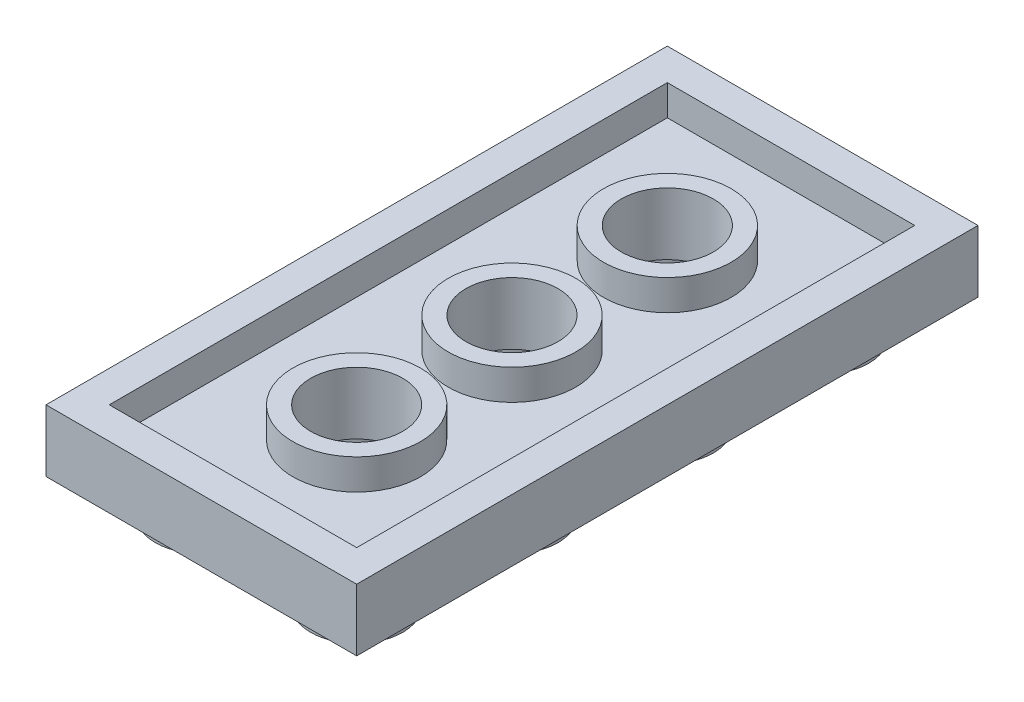
ISO-10303-21;
HEADER;
FILE_DESCRIPTION(('STEP AP214'),'2;1');
FILE_NAME('part.step','',(''),(''),'','','');
FILE_SCHEMA(('AUTOMOTIVE_DESIGN { 1 0 10303 214 1 1 1 1 }'));
ENDSEC;
DATA;
#1=APPLICATION_CONTEXT('core data for automotive mechanical design processes');
#2=APPLICATION_PROTOCOL_DEFINITION('international standard','automotive_design',2000,#1);
#3=PRODUCT_CONTEXT('',#1,'mechanical');
#4=PRODUCT('Part','Part','',(#3));
#5=PRODUCT_RELATED_PRODUCT_CATEGORY('part','',(#4));
#6=PRODUCT_DEFINITION_FORMATION('','',#4);
#7=PRODUCT_DEFINITION_CONTEXT('part definition',#1,'design');
#8=PRODUCT_DEFINITION('design','',#6,#7);
#9=PRODUCT_DEFINITION_SHAPE('','',#8);
#10=(LENGTH_UNIT() NAMED_UNIT(*) SI_UNIT(.MILLI.,.METRE.));
#11=(NAMED_UNIT(*) PLANE_ANGLE_UNIT() SI_UNIT($,.RADIAN.));
#12=(NAMED_UNIT(*) SI_UNIT($,.STERADIAN.) SOLID_ANGLE_UNIT());
#13=UNCERTAINTY_MEASURE_WITH_UNIT(LENGTH_MEASURE(1.E-05),#10,'distance_accuracy_value','');
#14=(GEOMETRIC_REPRESENTATION_CONTEXT(3) GLOBAL_UNCERTAINTY_ASSIGNED_CONTEXT((#13)) GLOBAL_UNIT_ASSIGNED_CONTEXT((#10,
#11,#12)) REPRESENTATION_CONTEXT('',''));
#15=CARTESIAN_POINT('',(0.,0.,0.));
#16=DIRECTION('',(0.,0.,1.));
#17=DIRECTION('',(1.,0.,0.));
#18=AXIS2_PLACEMENT_3D('',#15,#16,#17);
#19=CARTESIAN_POINT('',(0.,1.6425,0.));
#20=DIRECTION('',(0.,1.,0.));
#21=DIRECTION('',(0.,0.,1.));
#22=AXIS2_PLACEMENT_3D('',#19,#20,#21);
#23=PLANE('',#22);
#24=CARTESIAN_POINT('',(0.,1.6425,-8.06499999999999));
#25=DIRECTION('',(0.,-1.,0.));
#26=DIRECTION('',(0.,0.,-1.));
#27=AXIS2_PLACEMENT_3D('',#24,#25,#26);
#28=CIRCLE('',#27,3.31281619026951);
#29=CARTESIAN_POINT('',(0.,1.6425,-11.3778161902695));
#30=VERTEX_POINT('',#29);
#31=EDGE_CURVE('E178',#30,#30,#28,.F.);
#32=ORIENTED_EDGE('',*,*,#31,.F.);
#33=EDGE_LOOP('',(#32));
#34=FACE_BOUND('',#33,.T.);
#35=CARTESIAN_POINT('',(0.,1.6425,-16.13));
#36=DIRECTION('',(0.,-1.,0.));
#37=DIRECTION('',(0.,0.,-1.));
#38=AXIS2_PLACEMENT_3D('',#35,#36,#37);
#39=CIRCLE('',#38,3.31281619026951);
#40=CARTESIAN_POINT('',(0.,1.6425,-19.4428161902695));
#41=VERTEX_POINT('',#40);
#42=EDGE_CURVE('E181',#41,#41,#39,.F.);
#43=ORIENTED_EDGE('',*,*,#42,.F.);
#44=EDGE_LOOP('',(#43));
#45=FACE_BOUND('',#44,.T.);
#46=CARTESIAN_POINT('',(0.,1.6425,-24.195));
#47=DIRECTION('',(0.,-1.,0.));
#48=DIRECTION('',(0.,0.,-1.));
#49=AXIS2_PLACEMENT_3D('',#46,#47,#48);
#50=CIRCLE('',#49,3.31281619026951);
#51=CARTESIAN_POINT('',(0.,1.6425,-27.5078161902695));
#52=VERTEX_POINT('',#51);
#53=EDGE_CURVE('E19',#52,#52,#50,.F.);
#54=ORIENTED_EDGE('',*,*,#53,.F.);
#55=EDGE_LOOP('',(#54));
#56=FACE_BOUND('',#55,.T.);
#57=DIRECTION('',(-1.,0.,0.));
#58=VECTOR('',#57,1.);
#59=CARTESIAN_POINT('',(8.065,1.6425,-30.6175));
#60=LINE('',#59,#58);
#61=CARTESIAN_POINT('',(6.4225,1.6425,-30.6175));
#62=VERTEX_POINT('',#61);
#63=CARTESIAN_POINT('',(-6.4225,1.6425,-30.6175));
#64=VERTEX_POINT('',#63);
#65=EDGE_CURVE('E85',#62,#64,#60,.T.);
#66=ORIENTED_EDGE('',*,*,#65,.T.);
#67=DIRECTION('',(0.,0.,1.));
#68=VECTOR('',#67,1.);
#69=CARTESIAN_POINT('',(-6.4225,1.6425,-32.26));
#70=LINE('',#69,#68);
#71=CARTESIAN_POINT('',(-6.4225,1.6425,-1.6425));
#72=VERTEX_POINT('',#71);
#73=EDGE_CURVE('E190',#64,#72,#70,.T.);
#74=ORIENTED_EDGE('',*,*,#73,.T.);
#75=DIRECTION('',(1.,0.,0.));
#76=VECTOR('',#75,1.);
#77=CARTESIAN_POINT('',(-8.065,1.6425,-1.6425));
#78=LINE('',#77,#76);
#79=CARTESIAN_POINT('',(6.4225,1.6425,-1.6425));
#80=VERTEX_POINT('',#79);
#81=EDGE_CURVE('E97',#72,#80,#78,.T.);
#82=ORIENTED_EDGE('',*,*,#81,.T.);
#83=DIRECTION('',(0.,0.,-1.));
#84=VECTOR('',#83,1.);
#85=CARTESIAN_POINT('',(6.4225,1.6425,0.));
#86=LINE('',#85,#84);
#87=EDGE_CURVE('E79',#80,#62,#86,.T.);
#88=ORIENTED_EDGE('',*,*,#87,.T.);
#89=EDGE_LOOP('',(#66,#74,#82,#88));
#90=FACE_BOUND('',#89,.T.);
#91=ADVANCED_FACE('F16',(#34,#45,#56,#90),#23,.T.);
#92=CARTESIAN_POINT('',(8.065,0.,-30.6175));
#93=DIRECTION('',(0.,0.,-1.));
#94=DIRECTION('',(-1.,0.,0.));
#95=AXIS2_PLACEMENT_3D('',#92,#93,#94);
#96=PLANE('',#95);
#97=ORIENTED_EDGE('',*,*,#65,.F.);
#98=DIRECTION('',(0.,1.,0.));
#99=VECTOR('',#98,1.);
#100=CARTESIAN_POINT('',(6.4225,0.,-30.6175));
#101=LINE('',#100,#99);
#102=CARTESIAN_POINT('',(6.4225,3.226,-30.6175));
#103=VERTEX_POINT('',#102);
#104=EDGE_CURVE('E88',#62,#103,#101,.T.);
#105=ORIENTED_EDGE('',*,*,#104,.T.);
#106=DIRECTION('',(1.,0.,0.));
#107=VECTOR('',#106,1.);
#108=CARTESIAN_POINT('',(0.,3.226,-30.6175));
#109=LINE('',#108,#107);
#110=CARTESIAN_POINT('',(-6.4225,3.226,-30.6175));
#111=VERTEX_POINT('',#110);
#112=EDGE_CURVE('E180',#111,#103,#109,.T.);
#113=ORIENTED_EDGE('',*,*,#112,.F.);
#114=DIRECTION('',(0.,1.,0.));
#115=VECTOR('',#114,1.);
#116=CARTESIAN_POINT('',(-6.4225,0.,-30.6175));
#117=LINE('',#116,#115);
#118=EDGE_CURVE('E90',#111,#64,#117,.F.);
#119=ORIENTED_EDGE('',*,*,#118,.T.);
#120=EDGE_LOOP('',(#97,#105,#113,#119));
#121=FACE_BOUND('',#120,.T.);
#122=ADVANCED_FACE('F86',(#121),#96,.F.);
#123=CARTESIAN_POINT('',(6.4225,0.,0.));
#124=DIRECTION('',(1.,0.,0.));
#125=DIRECTION('',(0.,0.,-1.));
#126=AXIS2_PLACEMENT_3D('',#123,#124,#125);
#127=PLANE('',#126);
#128=ORIENTED_EDGE('',*,*,#87,.F.);
#129=DIRECTION('',(0.,1.,0.));
#130=VECTOR('',#129,1.);
#131=CARTESIAN_POINT('',(6.4225,0.,-1.6425));
#132=LINE('',#131,#130);
#133=CARTESIAN_POINT('',(6.4225,3.226,-1.6425));
#134=VERTEX_POINT('',#133);
#135=EDGE_CURVE('E201',#80,#134,#132,.T.);
#136=ORIENTED_EDGE('',*,*,#135,.T.);
#137=DIRECTION('',(0.,0.,1.));
#138=VECTOR('',#137,1.);
#139=CARTESIAN_POINT('',(6.4225,3.226,0.));
#140=LINE('',#139,#138);
#141=EDGE_CURVE('E96',#103,#134,#140,.T.);
#142=ORIENTED_EDGE('',*,*,#141,.F.);
#143=ORIENTED_EDGE('',*,*,#104,.F.);
#144=EDGE_LOOP('',(#128,#136,#142,#143));
#145=FACE_BOUND('',#144,.T.);
#146=ADVANCED_FACE('F95',(#145),#127,.F.);
#147=CARTESIAN_POINT('',(-8.065,0.,-1.6425));
#148=DIRECTION('',(0.,0.,1.));
#149=DIRECTION('',(1.,0.,0.));
#150=AXIS2_PLACEMENT_3D('',#147,#148,#149);
#151=PLANE('',#150);
#152=ORIENTED_EDGE('',*,*,#81,.F.);
#153=DIRECTION('',(0.,1.,0.));
#154=VECTOR('',#153,1.);
#155=CARTESIAN_POINT('',(-6.4225,0.,-1.6425));
#156=LINE('',#155,#154);
#157=CARTESIAN_POINT('',(-6.4225,3.226,-1.6425));
#158=VERTEX_POINT('',#157);
#159=EDGE_CURVE('E186',#72,#158,#156,.T.);
#160=ORIENTED_EDGE('',*,*,#159,.T.);
#161=DIRECTION('',(1.,0.,0.));
#162=VECTOR('',#161,1.);
#163=CARTESIAN_POINT('',(0.,3.226,-1.6425));
#164=LINE('',#163,#162);
#165=EDGE_CURVE('E202',#134,#158,#164,.F.);
#166=ORIENTED_EDGE('',*,*,#165,.F.);
#167=ORIENTED_EDGE('',*,*,#135,.F.);
#168=EDGE_LOOP('',(#152,#160,#166,#167));
#169=FACE_BOUND('',#168,.T.);
#170=ADVANCED_FACE('F203',(#169),#151,.F.);
#171=CARTESIAN_POINT('',(-6.4225,0.,-32.26));
#172=DIRECTION('',(-1.,0.,0.));
#173=DIRECTION('',(0.,0.,1.));
#174=AXIS2_PLACEMENT_3D('',#171,#172,#173);
#175=PLANE('',#174);
#176=ORIENTED_EDGE('',*,*,#73,.F.);
#177=ORIENTED_EDGE('',*,*,#118,.F.);
#178=DIRECTION('',(0.,0.,1.));
#179=VECTOR('',#178,1.);
#180=CARTESIAN_POINT('',(-6.4225,3.226,0.));
#181=LINE('',#180,#179);
#182=EDGE_CURVE('E177',#158,#111,#181,.F.);
#183=ORIENTED_EDGE('',*,*,#182,.F.);
#184=ORIENTED_EDGE('',*,*,#159,.F.);
#185=EDGE_LOOP('',(#176,#177,#183,#184));
#186=FACE_BOUND('',#185,.T.);
#187=ADVANCED_FACE('F577',(#186),#175,.F.);
#188=CARTESIAN_POINT('',(0.,0.,-24.195));
#189=DIRECTION('',(0.,-1.,0.));
#190=DIRECTION('',(0.,0.,-1.));
#191=AXIS2_PLACEMENT_3D('',#188,#189,#190);
#192=CYLINDRICAL_SURFACE('',#191,3.31281619026951);
#193=ORIENTED_EDGE('',*,*,#53,.T.);
#194=EDGE_LOOP('',(#193));
#195=FACE_BOUND('',#194,.T.);
#196=CARTESIAN_POINT('',(0.,3.226,-24.195));
#197=DIRECTION('',(0.,-1.,0.));
#198=DIRECTION('',(0.,0.,-1.));
#199=AXIS2_PLACEMENT_3D('',#196,#197,#198);
#200=CIRCLE('',#199,3.31281619026951);
#201=CARTESIAN_POINT('',(0.,3.226,-27.5078161902695));
#202=VERTEX_POINT('',#201);
#203=EDGE_CURVE('E174',#202,#202,#200,.F.);
#204=ORIENTED_EDGE('',*,*,#203,.F.);
#205=EDGE_LOOP('',(#204));
#206=FACE_BOUND('',#205,.T.);
#207=ADVANCED_FACE('F571',(#195,#206),#192,.T.);
#208=CARTESIAN_POINT('',(0.,0.,-16.13));
#209=DIRECTION('',(0.,-1.,0.));
#210=DIRECTION('',(0.,0.,-1.));
#211=AXIS2_PLACEMENT_3D('',#208,#209,#210);
#212=CYLINDRICAL_SURFACE('',#211,3.31281619026951);
#213=ORIENTED_EDGE('',*,*,#42,.T.);
#214=EDGE_LOOP('',(#213));
#215=FACE_BOUND('',#214,.T.);
#216=CARTESIAN_POINT('',(0.,3.226,-16.13));
#217=DIRECTION('',(0.,-1.,0.));
#218=DIRECTION('',(0.,0.,-1.));
#219=AXIS2_PLACEMENT_3D('',#216,#217,#218);
#220=CIRCLE('',#219,3.31281619026951);
#221=CARTESIAN_POINT('',(0.,3.226,-19.4428161902695));
#222=VERTEX_POINT('',#221);
#223=EDGE_CURVE('E171',#222,#222,#220,.F.);
#224=ORIENTED_EDGE('',*,*,#223,.F.);
#225=EDGE_LOOP('',(#224));
#226=FACE_BOUND('',#225,.T.);
#227=ADVANCED_FACE('F264',(#215,#226),#212,.T.);
#228=CARTESIAN_POINT('',(0.,0.,-8.06499999999999));
#229=DIRECTION('',(0.,-1.,0.));
#230=DIRECTION('',(0.,0.,-1.));
#231=AXIS2_PLACEMENT_3D('',#228,#229,#230);
#232=CYLINDRICAL_SURFACE('',#231,3.31281619026951);
#233=ORIENTED_EDGE('',*,*,#31,.T.);
#234=EDGE_LOOP('',(#233));
#235=FACE_BOUND('',#234,.T.);
#236=CARTESIAN_POINT('',(0.,3.226,-8.06499999999999));
#237=DIRECTION('',(0.,-1.,0.));
#238=DIRECTION('',(0.,0.,-1.));
#239=AXIS2_PLACEMENT_3D('',#236,#237,#238);
#240=CIRCLE('',#239,3.31281619026951);
#241=CARTESIAN_POINT('',(0.,3.226,-11.3778161902695));
#242=VERTEX_POINT('',#241);
#243=EDGE_CURVE('E167',#242,#242,#240,.F.);
#244=ORIENTED_EDGE('',*,*,#243,.F.);
#245=EDGE_LOOP('',(#244));
#246=FACE_BOUND('',#245,.T.);
#247=ADVANCED_FACE('F254',(#235,#246),#232,.T.);
#248=CARTESIAN_POINT('',(0.,3.226,0.));
#249=DIRECTION('',(0.,1.,0.));
#250=DIRECTION('',(0.,0.,1.));
#251=AXIS2_PLACEMENT_3D('',#248,#249,#250);
#252=PLANE('',#251);
#253=ORIENTED_EDGE('',*,*,#165,.T.);
#254=ORIENTED_EDGE('',*,*,#182,.T.);
#255=ORIENTED_EDGE('',*,*,#112,.T.);
#256=ORIENTED_EDGE('',*,*,#141,.T.);
#257=EDGE_LOOP('',(#253,#254,#255,#256));
#258=FACE_BOUND('',#257,.T.);
#259=DIRECTION('',(-1.,0.,0.));
#260=VECTOR('',#259,1.);
#261=CARTESIAN_POINT('',(8.065,3.226,-32.26));
#262=LINE('',#261,#260);
#263=CARTESIAN_POINT('',(-8.065,3.226,-32.26));
#264=VERTEX_POINT('',#263);
#265=CARTESIAN_POINT('',(8.065,3.226,-32.26));
#266=VERTEX_POINT('',#265);
#267=EDGE_CURVE('E221',#264,#266,#262,.F.);
#268=ORIENTED_EDGE('',*,*,#267,.F.);
#269=DIRECTION('',(0.,0.,1.));
#270=VECTOR('',#269,1.);
#271=CARTESIAN_POINT('',(-8.065,3.226,-32.26));
#272=LINE('',#271,#270);
#273=CARTESIAN_POINT('',(-8.065,3.226,0.));
#274=VERTEX_POINT('',#273);
#275=EDGE_CURVE('E170',#274,#264,#272,.F.);
#276=ORIENTED_EDGE('',*,*,#275,.F.);
#277=DIRECTION('',(1.,0.,0.));
#278=VECTOR('',#277,1.);
#279=CARTESIAN_POINT('',(-8.065,3.226,0.));
#280=LINE('',#279,#278);
#281=CARTESIAN_POINT('',(8.065,3.226,0.));
#282=VERTEX_POINT('',#281);
#283=EDGE_CURVE('E210',#282,#274,#280,.F.);
#284=ORIENTED_EDGE('',*,*,#283,.F.);
#285=DIRECTION('',(0.,0.,-1.));
#286=VECTOR('',#285,1.);
#287=CARTESIAN_POINT('',(8.065,3.226,0.));
#288=LINE('',#287,#286);
#289=EDGE_CURVE('E214',#266,#282,#288,.F.);
#290=ORIENTED_EDGE('',*,*,#289,.F.);
#291=EDGE_LOOP('',(#268,#276,#284,#290));
#292=FACE_BOUND('',#291,.T.);
#293=ADVANCED_FACE('F251',(#258,#292),#252,.T.);
#294=CARTESIAN_POINT('',(0.,-1.78,0.));
#295=DIRECTION('',(0.,1.,0.));
#296=DIRECTION('',(0.,0.,1.));
#297=AXIS2_PLACEMENT_3D('',#294,#295,#296);
#298=PLANE('',#297);
#299=CARTESIAN_POINT('',(4.03250000000001,-1.78,-28.2275));
#300=DIRECTION('',(0.,1.,0.));
#301=DIRECTION('',(0.,0.,1.));
#302=AXIS2_PLACEMENT_3D('',#299,#300,#301);
#303=CIRCLE('',#302,2.39);
#304=CARTESIAN_POINT('',(4.03250000000001,-1.78,-25.8375));
#305=VERTEX_POINT('',#304);
#306=EDGE_CURVE('E164',#305,#305,#303,.T.);
#307=ORIENTED_EDGE('',*,*,#306,.F.);
#308=EDGE_LOOP('',(#307));
#309=FACE_BOUND('',#308,.T.);
#310=ADVANCED_FACE('F253',(#309),#298,.F.);
#311=CARTESIAN_POINT('',(-8.065,-1.78,0.));
#312=DIRECTION('',(0.,1.,0.));
#313=DIRECTION('',(0.,0.,1.));
#314=AXIS2_PLACEMENT_3D('',#311,#312,#313);
#315=PLANE('',#314);
#316=CARTESIAN_POINT('',(-4.0325,-1.78,-28.2275));
#317=DIRECTION('',(0.,1.,0.));
#318=DIRECTION('',(0.,0.,1.));
#319=AXIS2_PLACEMENT_3D('',#316,#317,#318);
#320=CIRCLE('',#319,2.39);
#321=CARTESIAN_POINT('',(-4.0325,-1.78,-25.8375));
#322=VERTEX_POINT('',#321);
#323=EDGE_CURVE('E161',#322,#322,#320,.T.);
#324=ORIENTED_EDGE('',*,*,#323,.F.);
#325=EDGE_LOOP('',(#324));
#326=FACE_BOUND('',#325,.T.);
#327=ADVANCED_FACE('F261',(#326),#315,.F.);
#328=CARTESIAN_POINT('',(0.,-1.78,8.065));
#329=DIRECTION('',(0.,1.,0.));
#330=DIRECTION('',(0.,0.,1.));
#331=AXIS2_PLACEMENT_3D('',#328,#329,#330);
#332=PLANE('',#331);
#333=CARTESIAN_POINT('',(4.03250000000001,-1.78,-20.1625));
#334=DIRECTION('',(0.,1.,0.));
#335=DIRECTION('',(0.,0.,1.));
#336=AXIS2_PLACEMENT_3D('',#333,#334,#335);
#337=CIRCLE('',#336,2.39);
#338=CARTESIAN_POINT('',(4.03250000000001,-1.78,-17.7725));
#339=VERTEX_POINT('',#338);
#340=EDGE_CURVE('E158',#339,#339,#337,.T.);
#341=ORIENTED_EDGE('',*,*,#340,.F.);
#342=EDGE_LOOP('',(#341));
#343=FACE_BOUND('',#342,.T.);
#344=ADVANCED_FACE('F358',(#343),#332,.F.);
#345=CARTESIAN_POINT('',(-8.065,-1.78,8.065));
#346=DIRECTION('',(0.,1.,0.));
#347=DIRECTION('',(0.,0.,1.));
#348=AXIS2_PLACEMENT_3D('',#345,#346,#347);
#349=PLANE('',#348);
#350=CARTESIAN_POINT('',(-4.0325,-1.78,-20.1625));
#351=DIRECTION('',(0.,1.,0.));
#352=DIRECTION('',(0.,0.,1.));
#353=AXIS2_PLACEMENT_3D('',#350,#351,#352);
#354=CIRCLE('',#353,2.39);
#355=CARTESIAN_POINT('',(-4.0325,-1.78,-17.7725));
#356=VERTEX_POINT('',#355);
#357=EDGE_CURVE('E155',#356,#356,#354,.T.);
#358=ORIENTED_EDGE('',*,*,#357,.F.);
#359=EDGE_LOOP('',(#358));
#360=FACE_BOUND('',#359,.T.);
#361=ADVANCED_FACE('F354',(#360),#349,.F.);
#362=CARTESIAN_POINT('',(0.,-1.78,16.13));
#363=DIRECTION('',(0.,1.,0.));
#364=DIRECTION('',(0.,0.,1.));
#365=AXIS2_PLACEMENT_3D('',#362,#363,#364);
#366=PLANE('',#365);
#367=CARTESIAN_POINT('',(4.03250000000001,-1.78,-12.0975));
#368=DIRECTION('',(0.,1.,0.));
#369=DIRECTION('',(0.,0.,1.));
#370=AXIS2_PLACEMENT_3D('',#367,#368,#369);
#371=CIRCLE('',#370,2.39);
#372=CARTESIAN_POINT('',(4.03250000000001,-1.78,-9.7075));
#373=VERTEX_POINT('',#372);
#374=EDGE_CURVE('E152',#373,#373,#371,.T.);
#375=ORIENTED_EDGE('',*,*,#374,.F.);
#376=EDGE_LOOP('',(#375));
#377=FACE_BOUND('',#376,.T.);
#378=ADVANCED_FACE('F350',(#377),#366,.F.);
#379=CARTESIAN_POINT('',(-8.065,-1.78,16.13));
#380=DIRECTION('',(0.,1.,0.));
#381=DIRECTION('',(0.,0.,1.));
#382=AXIS2_PLACEMENT_3D('',#379,#380,#381);
#383=PLANE('',#382);
#384=CARTESIAN_POINT('',(-4.0325,-1.78,-12.0975));
#385=DIRECTION('',(0.,1.,0.));
#386=DIRECTION('',(0.,0.,1.));
#387=AXIS2_PLACEMENT_3D('',#384,#385,#386);
#388=CIRCLE('',#387,2.39);
#389=CARTESIAN_POINT('',(-4.0325,-1.78,-9.7075));
#390=VERTEX_POINT('',#389);
#391=EDGE_CURVE('E149',#390,#390,#388,.T.);
#392=ORIENTED_EDGE('',*,*,#391,.F.);
#393=EDGE_LOOP('',(#392));
#394=FACE_BOUND('',#393,.T.);
#395=ADVANCED_FACE('F346',(#394),#383,.F.);
#396=CARTESIAN_POINT('',(0.,-1.78,24.195));
#397=DIRECTION('',(0.,1.,0.));
#398=DIRECTION('',(0.,0.,1.));
#399=AXIS2_PLACEMENT_3D('',#396,#397,#398);
#400=PLANE('',#399);
#401=CARTESIAN_POINT('',(4.03250000000001,-1.78,-4.0325));
#402=DIRECTION('',(0.,1.,0.));
#403=DIRECTION('',(0.,0.,1.));
#404=AXIS2_PLACEMENT_3D('',#401,#402,#403);
#405=CIRCLE('',#404,2.39);
#406=CARTESIAN_POINT('',(4.03250000000001,-1.78,-1.6425));
#407=VERTEX_POINT('',#406);
#408=EDGE_CURVE('E146',#407,#407,#405,.T.);
#409=ORIENTED_EDGE('',*,*,#408,.F.);
#410=EDGE_LOOP('',(#409));
#411=FACE_BOUND('',#410,.T.);
#412=ADVANCED_FACE('F342',(#411),#400,.F.);
#413=CARTESIAN_POINT('',(-8.065,-1.78,24.195));
#414=DIRECTION('',(0.,1.,0.));
#415=DIRECTION('',(0.,0.,1.));
#416=AXIS2_PLACEMENT_3D('',#413,#414,#415);
#417=PLANE('',#416);
#418=CARTESIAN_POINT('',(-4.0325,-1.78,-4.0325));
#419=DIRECTION('',(0.,1.,0.));
#420=DIRECTION('',(0.,0.,1.));
#421=AXIS2_PLACEMENT_3D('',#418,#419,#420);
#422=CIRCLE('',#421,2.39);
#423=CARTESIAN_POINT('',(-4.0325,-1.78,-1.6425));
#424=VERTEX_POINT('',#423);
#425=EDGE_CURVE('E143',#424,#424,#422,.T.);
#426=ORIENTED_EDGE('',*,*,#425,.F.);
#427=EDGE_LOOP('',(#426));
#428=FACE_BOUND('',#427,.T.);
#429=ADVANCED_FACE('F338',(#428),#417,.F.);
#430=CARTESIAN_POINT('',(0.,3.226,0.));
#431=DIRECTION('',(0.,1.,0.));
#432=DIRECTION('',(0.,0.,1.));
#433=AXIS2_PLACEMENT_3D('',#430,#431,#432);
#434=PLANE('',#433);
#435=CARTESIAN_POINT('',(0.,3.226,-24.195));
#436=DIRECTION('',(0.,-1.,0.));
#437=DIRECTION('',(0.,0.,-1.));
#438=AXIS2_PLACEMENT_3D('',#435,#436,#437);
#439=CIRCLE('',#438,2.39);
#440=CARTESIAN_POINT('',(0.,3.226,-26.585));
#441=VERTEX_POINT('',#440);
#442=EDGE_CURVE('E140',#441,#441,#439,.T.);
#443=ORIENTED_EDGE('',*,*,#442,.T.);
#444=EDGE_LOOP('',(#443));
#445=FACE_BOUND('',#444,.T.);
#446=ORIENTED_EDGE('',*,*,#203,.T.);
#447=EDGE_LOOP('',(#446));
#448=FACE_BOUND('',#447,.T.);
#449=ADVANCED_FACE('F334',(#445,#448),#434,.T.);
#450=CARTESIAN_POINT('',(0.,3.226,8.065));
#451=DIRECTION('',(0.,1.,0.));
#452=DIRECTION('',(0.,0.,1.));
#453=AXIS2_PLACEMENT_3D('',#450,#451,#452);
#454=PLANE('',#453);
#455=CARTESIAN_POINT('',(0.,3.226,-16.13));
#456=DIRECTION('',(0.,-1.,0.));
#457=DIRECTION('',(0.,0.,-1.));
#458=AXIS2_PLACEMENT_3D('',#455,#456,#457);
#459=CIRCLE('',#458,2.39);
#460=CARTESIAN_POINT('',(0.,3.226,-18.52));
#461=VERTEX_POINT('',#460);
#462=EDGE_CURVE('E137',#461,#461,#459,.T.);
#463=ORIENTED_EDGE('',*,*,#462,.T.);
#464=EDGE_LOOP('',(#463));
#465=FACE_BOUND('',#464,.T.);
#466=ORIENTED_EDGE('',*,*,#223,.T.);
#467=EDGE_LOOP('',(#466));
#468=FACE_BOUND('',#467,.T.);
#469=ADVANCED_FACE('F330',(#465,#468),#454,.T.);
#470=CARTESIAN_POINT('',(0.,3.226,16.13));
#471=DIRECTION('',(0.,1.,0.));
#472=DIRECTION('',(0.,0.,1.));
#473=AXIS2_PLACEMENT_3D('',#470,#471,#472);
#474=PLANE('',#473);
#475=CARTESIAN_POINT('',(0.,3.226,-8.06499999999999));
#476=DIRECTION('',(0.,-1.,0.));
#477=DIRECTION('',(0.,0.,-1.));
#478=AXIS2_PLACEMENT_3D('',#475,#476,#477);
#479=CIRCLE('',#478,2.39);
#480=CARTESIAN_POINT('',(0.,3.226,-10.455));
#481=VERTEX_POINT('',#480);
#482=EDGE_CURVE('E133',#481,#481,#479,.T.);
#483=ORIENTED_EDGE('',*,*,#482,.T.);
#484=EDGE_LOOP('',(#483));
#485=FACE_BOUND('',#484,.T.);
#486=ORIENTED_EDGE('',*,*,#243,.T.);
#487=EDGE_LOOP('',(#486));
#488=FACE_BOUND('',#487,.T.);
#489=ADVANCED_FACE('F327',(#485,#488),#474,.T.);
#490=CARTESIAN_POINT('',(-8.065,0.,-32.26));
#491=DIRECTION('',(-1.,0.,0.));
#492=DIRECTION('',(0.,0.,1.));
#493=AXIS2_PLACEMENT_3D('',#490,#491,#492);
#494=PLANE('',#493);
#495=DIRECTION('',(0.,1.,0.));
#496=VECTOR('',#495,1.);
#497=CARTESIAN_POINT('',(-8.065,0.,-32.26));
#498=LINE('',#497,#496);
#499=CARTESIAN_POINT('',(-8.065,0.,-32.26));
#500=VERTEX_POINT('',#499);
#501=EDGE_CURVE('E218',#500,#264,#498,.T.);
#502=ORIENTED_EDGE('',*,*,#501,.F.);
#503=DIRECTION('',(0.,0.,1.));
#504=VECTOR('',#503,1.);
#505=CARTESIAN_POINT('',(-8.065,0.,0.));
#506=LINE('',#505,#504);
#507=CARTESIAN_POINT('',(-8.065,0.,0.));
#508=VERTEX_POINT('',#507);
#509=EDGE_CURVE('E136',#500,#508,#506,.T.);
#510=ORIENTED_EDGE('',*,*,#509,.T.);
#511=DIRECTION('',(0.,1.,0.));
#512=VECTOR('',#511,1.);
#513=CARTESIAN_POINT('',(-8.065,0.,0.));
#514=LINE('',#513,#512);
#515=EDGE_CURVE('E212',#274,#508,#514,.F.);
#516=ORIENTED_EDGE('',*,*,#515,.F.);
#517=ORIENTED_EDGE('',*,*,#275,.T.);
#518=EDGE_LOOP('',(#502,#510,#516,#517));
#519=FACE_BOUND('',#518,.T.);
#520=ADVANCED_FACE('F249',(#519),#494,.T.);
#521=CARTESIAN_POINT('',(-8.065,0.,0.));
#522=DIRECTION('',(0.,0.,1.));
#523=DIRECTION('',(1.,0.,0.));
#524=AXIS2_PLACEMENT_3D('',#521,#522,#523);
#525=PLANE('',#524);
#526=ORIENTED_EDGE('',*,*,#515,.T.);
#527=DIRECTION('',(1.,0.,0.));
#528=VECTOR('',#527,1.);
#529=CARTESIAN_POINT('',(0.,0.,0.));
#530=LINE('',#529,#528);
#531=CARTESIAN_POINT('',(8.065,0.,0.));
#532=VERTEX_POINT('',#531);
#533=EDGE_CURVE('E226',#508,#532,#530,.T.);
#534=ORIENTED_EDGE('',*,*,#533,.T.);
#535=DIRECTION('',(0.,1.,0.));
#536=VECTOR('',#535,1.);
#537=CARTESIAN_POINT('',(8.065,0.,0.));
#538=LINE('',#537,#536);
#539=EDGE_CURVE('E216',#282,#532,#538,.F.);
#540=ORIENTED_EDGE('',*,*,#539,.F.);
#541=ORIENTED_EDGE('',*,*,#283,.T.);
#542=EDGE_LOOP('',(#526,#534,#540,#541));
#543=FACE_BOUND('',#542,.T.);
#544=ADVANCED_FACE('F245',(#543),#525,.T.);
#545=CARTESIAN_POINT('',(8.065,0.,0.));
#546=DIRECTION('',(1.,0.,0.));
#547=DIRECTION('',(0.,0.,-1.));
#548=AXIS2_PLACEMENT_3D('',#545,#546,#547);
#549=PLANE('',#548);
#550=ORIENTED_EDGE('',*,*,#539,.T.);
#551=DIRECTION('',(0.,0.,1.));
#552=VECTOR('',#551,1.);
#553=CARTESIAN_POINT('',(8.065,0.,0.));
#554=LINE('',#553,#552);
#555=CARTESIAN_POINT('',(8.065,0.,-32.26));
#556=VERTEX_POINT('',#555);
#557=EDGE_CURVE('E229',#532,#556,#554,.F.);
#558=ORIENTED_EDGE('',*,*,#557,.T.);
#559=DIRECTION('',(0.,1.,0.));
#560=VECTOR('',#559,1.);
#561=CARTESIAN_POINT('',(8.065,0.,-32.26));
#562=LINE('',#561,#560);
#563=EDGE_CURVE('E34',#266,#556,#562,.F.);
#564=ORIENTED_EDGE('',*,*,#563,.F.);
#565=ORIENTED_EDGE('',*,*,#289,.T.);
#566=EDGE_LOOP('',(#550,#558,#564,#565));
#567=FACE_BOUND('',#566,.T.);
#568=ADVANCED_FACE('F240',(#567),#549,.T.);
#569=CARTESIAN_POINT('',(8.065,0.,-32.26));
#570=DIRECTION('',(0.,0.,-1.));
#571=DIRECTION('',(-1.,0.,0.));
#572=AXIS2_PLACEMENT_3D('',#569,#570,#571);
#573=PLANE('',#572);
#574=ORIENTED_EDGE('',*,*,#563,.T.);
#575=DIRECTION('',(1.,0.,0.));
#576=VECTOR('',#575,1.);
#577=CARTESIAN_POINT('',(0.,0.,-32.26));
#578=LINE('',#577,#576);
#579=EDGE_CURVE('E132',#556,#500,#578,.F.);
#580=ORIENTED_EDGE('',*,*,#579,.T.);
#581=ORIENTED_EDGE('',*,*,#501,.T.);
#582=ORIENTED_EDGE('',*,*,#267,.T.);
#583=EDGE_LOOP('',(#574,#580,#581,#582));
#584=FACE_BOUND('',#583,.T.);
#585=ADVANCED_FACE('F232',(#584),#573,.T.);
#586=CARTESIAN_POINT('',(4.03250000000001,0.,-28.2275));
#587=DIRECTION('',(0.,1.,0.));
#588=DIRECTION('',(0.,0.,1.));
#589=AXIS2_PLACEMENT_3D('',#586,#587,#588);
#590=CYLINDRICAL_SURFACE('',#589,2.39);
#591=ORIENTED_EDGE('',*,*,#306,.T.);
#592=EDGE_LOOP('',(#591));
#593=FACE_BOUND('',#592,.T.);
#594=CARTESIAN_POINT('',(4.03250000000001,0.,-28.2275));
#595=DIRECTION('',(0.,1.,0.));
#596=DIRECTION('',(0.,0.,1.));
#597=AXIS2_PLACEMENT_3D('',#594,#595,#596);
#598=CIRCLE('',#597,2.39);
#599=CARTESIAN_POINT('',(4.03250000000001,0.,-25.8375));
#600=VERTEX_POINT('',#599);
#601=EDGE_CURVE('E129',#600,#600,#598,.F.);
#602=ORIENTED_EDGE('',*,*,#601,.T.);
#603=EDGE_LOOP('',(#602));
#604=FACE_BOUND('',#603,.T.);
#605=ADVANCED_FACE('F314',(#593,#604),#590,.T.);
#606=CARTESIAN_POINT('',(-4.0325,0.,-28.2275));
#607=DIRECTION('',(0.,1.,0.));
#608=DIRECTION('',(0.,0.,1.));
#609=AXIS2_PLACEMENT_3D('',#606,#607,#608);
#610=CYLINDRICAL_SURFACE('',#609,2.39);
#611=ORIENTED_EDGE('',*,*,#323,.T.);
#612=EDGE_LOOP('',(#611));
#613=FACE_BOUND('',#612,.T.);
#614=CARTESIAN_POINT('',(-4.0325,0.,-28.2275));
#615=DIRECTION('',(0.,1.,0.));
#616=DIRECTION('',(0.,0.,1.));
#617=AXIS2_PLACEMENT_3D('',#614,#615,#616);
#618=CIRCLE('',#617,2.39);
#619=CARTESIAN_POINT('',(-4.0325,0.,-25.8375));
#620=VERTEX_POINT('',#619);
#621=EDGE_CURVE('E126',#620,#620,#618,.F.);
#622=ORIENTED_EDGE('',*,*,#621,.T.);
#623=EDGE_LOOP('',(#622));
#624=FACE_BOUND('',#623,.T.);
#625=ADVANCED_FACE('F310',(#613,#624),#610,.T.);
#626=CARTESIAN_POINT('',(4.03250000000001,0.,-20.1625));
#627=DIRECTION('',(0.,1.,0.));
#628=DIRECTION('',(0.,0.,1.));
#629=AXIS2_PLACEMENT_3D('',#626,#627,#628);
#630=CYLINDRICAL_SURFACE('',#629,2.39);
#631=ORIENTED_EDGE('',*,*,#340,.T.);
#632=EDGE_LOOP('',(#631));
#633=FACE_BOUND('',#632,.T.);
#634=CARTESIAN_POINT('',(4.03250000000001,0.,-20.1625));
#635=DIRECTION('',(0.,1.,0.));
#636=DIRECTION('',(0.,0.,1.));
#637=AXIS2_PLACEMENT_3D('',#634,#635,#636);
#638=CIRCLE('',#637,2.39);
#639=CARTESIAN_POINT('',(4.03250000000001,0.,-17.7725));
#640=VERTEX_POINT('',#639);
#641=EDGE_CURVE('E123',#640,#640,#638,.F.);
#642=ORIENTED_EDGE('',*,*,#641,.T.);
#643=EDGE_LOOP('',(#642));
#644=FACE_BOUND('',#643,.T.);
#645=ADVANCED_FACE('F306',(#633,#644),#630,.T.);
#646=CARTESIAN_POINT('',(-4.0325,0.,-20.1625));
#647=DIRECTION('',(0.,1.,0.));
#648=DIRECTION('',(0.,0.,1.));
#649=AXIS2_PLACEMENT_3D('',#646,#647,#648);
#650=CYLINDRICAL_SURFACE('',#649,2.39);
#651=ORIENTED_EDGE('',*,*,#357,.T.);
#652=EDGE_LOOP('',(#651));
#653=FACE_BOUND('',#652,.T.);
#654=CARTESIAN_POINT('',(-4.0325,0.,-20.1625));
#655=DIRECTION('',(0.,1.,0.));
#656=DIRECTION('',(0.,0.,1.));
#657=AXIS2_PLACEMENT_3D('',#654,#655,#656);
#658=CIRCLE('',#657,2.39);
#659=CARTESIAN_POINT('',(-4.0325,0.,-17.7725));
#660=VERTEX_POINT('',#659);
#661=EDGE_CURVE('E120',#660,#660,#658,.F.);
#662=ORIENTED_EDGE('',*,*,#661,.T.);
#663=EDGE_LOOP('',(#662));
#664=FACE_BOUND('',#663,.T.);
#665=ADVANCED_FACE('F302',(#653,#664),#650,.T.);
#666=CARTESIAN_POINT('',(4.03250000000001,0.,-12.0975));
#667=DIRECTION('',(0.,1.,0.));
#668=DIRECTION('',(0.,0.,1.));
#669=AXIS2_PLACEMENT_3D('',#666,#667,#668);
#670=CYLINDRICAL_SURFACE('',#669,2.39);
#671=ORIENTED_EDGE('',*,*,#374,.T.);
#672=EDGE_LOOP('',(#671));
#673=FACE_BOUND('',#672,.T.);
#674=CARTESIAN_POINT('',(4.03250000000001,0.,-12.0975));
#675=DIRECTION('',(0.,1.,0.));
#676=DIRECTION('',(0.,0.,1.));
#677=AXIS2_PLACEMENT_3D('',#674,#675,#676);
#678=CIRCLE('',#677,2.39);
#679=CARTESIAN_POINT('',(4.03250000000001,0.,-9.7075));
#680=VERTEX_POINT('',#679);
#681=EDGE_CURVE('E117',#680,#680,#678,.F.);
#682=ORIENTED_EDGE('',*,*,#681,.T.);
#683=EDGE_LOOP('',(#682));
#684=FACE_BOUND('',#683,.T.);
#685=ADVANCED_FACE('F298',(#673,#684),#670,.T.);
#686=CARTESIAN_POINT('',(-4.0325,0.,-12.0975));
#687=DIRECTION('',(0.,1.,0.));
#688=DIRECTION('',(0.,0.,1.));
#689=AXIS2_PLACEMENT_3D('',#686,#687,#688);
#690=CYLINDRICAL_SURFACE('',#689,2.39);
#691=ORIENTED_EDGE('',*,*,#391,.T.);
#692=EDGE_LOOP('',(#691));
#693=FACE_BOUND('',#692,.T.);
#694=CARTESIAN_POINT('',(-4.0325,0.,-12.0975));
#695=DIRECTION('',(0.,1.,0.));
#696=DIRECTION('',(0.,0.,1.));
#697=AXIS2_PLACEMENT_3D('',#694,#695,#696);
#698=CIRCLE('',#697,2.39);
#699=CARTESIAN_POINT('',(-4.0325,0.,-9.7075));
#700=VERTEX_POINT('',#699);
#701=EDGE_CURVE('E114',#700,#700,#698,.F.);
#702=ORIENTED_EDGE('',*,*,#701,.T.);
#703=EDGE_LOOP('',(#702));
#704=FACE_BOUND('',#703,.T.);
#705=ADVANCED_FACE('F294',(#693,#704),#690,.T.);
#706=CARTESIAN_POINT('',(4.03250000000001,0.,-4.0325));
#707=DIRECTION('',(0.,1.,0.));
#708=DIRECTION('',(0.,0.,1.));
#709=AXIS2_PLACEMENT_3D('',#706,#707,#708);
#710=CYLINDRICAL_SURFACE('',#709,2.39);
#711=ORIENTED_EDGE('',*,*,#408,.T.);
#712=EDGE_LOOP('',(#711));
#713=FACE_BOUND('',#712,.T.);
#714=CARTESIAN_POINT('',(4.03250000000001,0.,-4.0325));
#715=DIRECTION('',(0.,1.,0.));
#716=DIRECTION('',(0.,0.,1.));
#717=AXIS2_PLACEMENT_3D('',#714,#715,#716);
#718=CIRCLE('',#717,2.39);
#719=CARTESIAN_POINT('',(4.03250000000001,0.,-1.6425));
#720=VERTEX_POINT('',#719);
#721=EDGE_CURVE('E111',#720,#720,#718,.F.);
#722=ORIENTED_EDGE('',*,*,#721,.T.);
#723=EDGE_LOOP('',(#722));
#724=FACE_BOUND('',#723,.T.);
#725=ADVANCED_FACE('F290',(#713,#724),#710,.T.);
#726=CARTESIAN_POINT('',(-4.0325,0.,-4.0325));
#727=DIRECTION('',(0.,1.,0.));
#728=DIRECTION('',(0.,0.,1.));
#729=AXIS2_PLACEMENT_3D('',#726,#727,#728);
#730=CYLINDRICAL_SURFACE('',#729,2.39);
#731=ORIENTED_EDGE('',*,*,#425,.T.);
#732=EDGE_LOOP('',(#731));
#733=FACE_BOUND('',#732,.T.);
#734=CARTESIAN_POINT('',(-4.0325,0.,-4.0325));
#735=DIRECTION('',(0.,1.,0.));
#736=DIRECTION('',(0.,0.,1.));
#737=AXIS2_PLACEMENT_3D('',#734,#735,#736);
#738=CIRCLE('',#737,2.39);
#739=CARTESIAN_POINT('',(-4.0325,0.,-1.6425));
#740=VERTEX_POINT('',#739);
#741=EDGE_CURVE('E108',#740,#740,#738,.F.);
#742=ORIENTED_EDGE('',*,*,#741,.T.);
#743=EDGE_LOOP('',(#742));
#744=FACE_BOUND('',#743,.T.);
#745=ADVANCED_FACE('F286',(#733,#744),#730,.T.);
#746=CARTESIAN_POINT('',(0.,-5.,-24.195));
#747=DIRECTION('',(0.,-1.,0.));
#748=DIRECTION('',(0.,0.,-1.));
#749=AXIS2_PLACEMENT_3D('',#746,#747,#748);
#750=CYLINDRICAL_SURFACE('',#749,2.39);
#751=CARTESIAN_POINT('',(0.,0.,-24.195));
#752=DIRECTION('',(0.,-1.,0.));
#753=DIRECTION('',(0.,0.,-1.));
#754=AXIS2_PLACEMENT_3D('',#751,#752,#753);
#755=CIRCLE('',#754,2.39);
#756=CARTESIAN_POINT('',(0.,0.,-26.585));
#757=VERTEX_POINT('',#756);
#758=EDGE_CURVE('E105',#757,#757,#755,.T.);
#759=ORIENTED_EDGE('',*,*,#758,.T.);
#760=EDGE_LOOP('',(#759));
#761=FACE_BOUND('',#760,.T.);
#762=ORIENTED_EDGE('',*,*,#442,.F.);
#763=EDGE_LOOP('',(#762));
#764=FACE_BOUND('',#763,.T.);
#765=ADVANCED_FACE('F282',(#761,#764),#750,.F.);
#766=CARTESIAN_POINT('',(0.,-5.,-16.13));
#767=DIRECTION('',(0.,-1.,0.));
#768=DIRECTION('',(0.,0.,-1.));
#769=AXIS2_PLACEMENT_3D('',#766,#767,#768);
#770=CYLINDRICAL_SURFACE('',#769,2.39);
#771=CARTESIAN_POINT('',(0.,0.,-16.13));
#772=DIRECTION('',(0.,-1.,0.));
#773=DIRECTION('',(0.,0.,-1.));
#774=AXIS2_PLACEMENT_3D('',#771,#772,#773);
#775=CIRCLE('',#774,2.39);
#776=CARTESIAN_POINT('',(0.,0.,-18.52));
#777=VERTEX_POINT('',#776);
#778=EDGE_CURVE('E25',#777,#777,#775,.T.);
#779=ORIENTED_EDGE('',*,*,#778,.T.);
#780=EDGE_LOOP('',(#779));
#781=FACE_BOUND('',#780,.T.);
#782=ORIENTED_EDGE('',*,*,#462,.F.);
#783=EDGE_LOOP('',(#782));
#784=FACE_BOUND('',#783,.T.);
#785=ADVANCED_FACE('F274',(#781,#784),#770,.F.);
#786=CARTESIAN_POINT('',(0.,-5.,-8.06499999999999));
#787=DIRECTION('',(0.,-1.,0.));
#788=DIRECTION('',(0.,0.,-1.));
#789=AXIS2_PLACEMENT_3D('',#786,#787,#788);
#790=CYLINDRICAL_SURFACE('',#789,2.39);
#791=CARTESIAN_POINT('',(0.,0.,-8.06499999999999));
#792=DIRECTION('',(0.,-1.,0.));
#793=DIRECTION('',(0.,0.,-1.));
#794=AXIS2_PLACEMENT_3D('',#791,#792,#793);
#795=CIRCLE('',#794,2.39);
#796=CARTESIAN_POINT('',(0.,0.,-10.455));
#797=VERTEX_POINT('',#796);
#798=EDGE_CURVE('E10',#797,#797,#795,.T.);
#799=ORIENTED_EDGE('',*,*,#798,.T.);
#800=EDGE_LOOP('',(#799));
#801=FACE_BOUND('',#800,.T.);
#802=ORIENTED_EDGE('',*,*,#482,.F.);
#803=EDGE_LOOP('',(#802));
#804=FACE_BOUND('',#803,.T.);
#805=ADVANCED_FACE('F268',(#801,#804),#790,.F.);
#806=CARTESIAN_POINT('',(0.,0.,0.));
#807=DIRECTION('',(0.,1.,0.));
#808=DIRECTION('',(0.,0.,1.));
#809=AXIS2_PLACEMENT_3D('',#806,#807,#808);
#810=PLANE('',#809);
#811=ORIENTED_EDGE('',*,*,#798,.F.);
#812=EDGE_LOOP('',(#811));
#813=FACE_BOUND('',#812,.T.);
#814=ORIENTED_EDGE('',*,*,#778,.F.);
#815=EDGE_LOOP('',(#814));
#816=FACE_BOUND('',#815,.T.);
#817=ORIENTED_EDGE('',*,*,#758,.F.);
#818=EDGE_LOOP('',(#817));
#819=FACE_BOUND('',#818,.T.);
#820=ORIENTED_EDGE('',*,*,#741,.F.);
#821=EDGE_LOOP('',(#820));
#822=FACE_BOUND('',#821,.T.);
#823=ORIENTED_EDGE('',*,*,#721,.F.);
#824=EDGE_LOOP('',(#823));
#825=FACE_BOUND('',#824,.T.);
#826=ORIENTED_EDGE('',*,*,#701,.F.);
#827=EDGE_LOOP('',(#826));
#828=FACE_BOUND('',#827,.T.);
#829=ORIENTED_EDGE('',*,*,#681,.F.);
#830=EDGE_LOOP('',(#829));
#831=FACE_BOUND('',#830,.T.);
#832=ORIENTED_EDGE('',*,*,#661,.F.);
#833=EDGE_LOOP('',(#832));
#834=FACE_BOUND('',#833,.T.);
#835=ORIENTED_EDGE('',*,*,#641,.F.);
#836=EDGE_LOOP('',(#835));
#837=FACE_BOUND('',#836,.T.);
#838=ORIENTED_EDGE('',*,*,#621,.F.);
#839=EDGE_LOOP('',(#838));
#840=FACE_BOUND('',#839,.T.);
#841=ORIENTED_EDGE('',*,*,#601,.F.);
#842=EDGE_LOOP('',(#841));
#843=FACE_BOUND('',#842,.T.);
#844=ORIENTED_EDGE('',*,*,#557,.F.);
#845=ORIENTED_EDGE('',*,*,#533,.F.);
#846=ORIENTED_EDGE('',*,*,#509,.F.);
#847=ORIENTED_EDGE('',*,*,#579,.F.);
#848=EDGE_LOOP('',(#844,#845,#846,#847));
#849=FACE_BOUND('',#848,.T.);
#850=ADVANCED_FACE('F237',(#813,#816,#819,#822,#825,#828,#831,#834,#837,#840,#843,#849),#810,.F.);
#851=CLOSED_SHELL('',(#91,#122,#146,#170,#187,#207,#227,#247,#293,#310,#327,#344,#361,#378,#395,
#412,#429,#449,#469,#489,#520,#544,#568,#585,#605,#625,#645,#665,#685,#705,#725,#745,#765,#785,
#805,#850));
#852=MANIFOLD_SOLID_BREP('B1',#851);
#853=ADVANCED_BREP_SHAPE_REPRESENTATION('',(#18,#852),#14);
#854=SHAPE_DEFINITION_REPRESENTATION(#9,#853);
ENDSEC;
END-ISO-10303-21;
